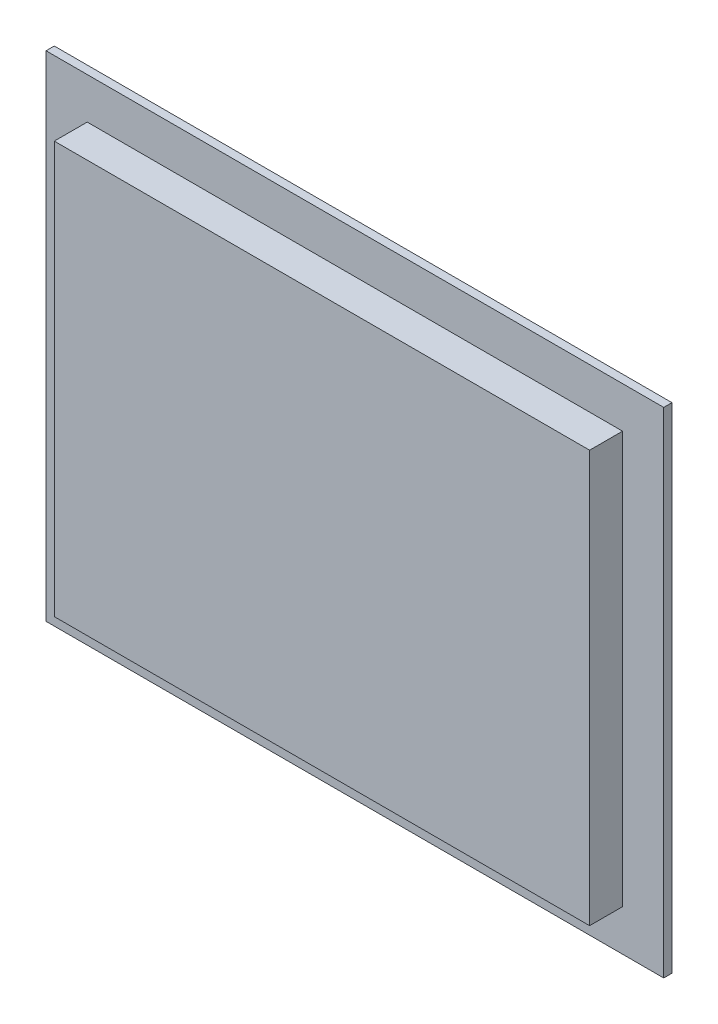
ISO-10303-21;
HEADER;
FILE_DESCRIPTION(('STEP AP214'),'2;1');
FILE_NAME('part.step','',(''),(''),'','','');
FILE_SCHEMA(('AUTOMOTIVE_DESIGN { 1 0 10303 214 1 1 1 1 }'));
ENDSEC;
DATA;
#1=APPLICATION_CONTEXT('core data for automotive mechanical design processes');
#2=APPLICATION_PROTOCOL_DEFINITION('international standard','automotive_design',2000,#1);
#3=PRODUCT_CONTEXT('',#1,'mechanical');
#4=PRODUCT('Part','Part','',(#3));
#5=PRODUCT_RELATED_PRODUCT_CATEGORY('part','',(#4));
#6=PRODUCT_DEFINITION_FORMATION('','',#4);
#7=PRODUCT_DEFINITION_CONTEXT('part definition',#1,'design');
#8=PRODUCT_DEFINITION('design','',#6,#7);
#9=PRODUCT_DEFINITION_SHAPE('','',#8);
#10=(LENGTH_UNIT() NAMED_UNIT(*) SI_UNIT(.MILLI.,.METRE.));
#11=(NAMED_UNIT(*) PLANE_ANGLE_UNIT() SI_UNIT($,.RADIAN.));
#12=(NAMED_UNIT(*) SI_UNIT($,.STERADIAN.) SOLID_ANGLE_UNIT());
#13=UNCERTAINTY_MEASURE_WITH_UNIT(LENGTH_MEASURE(1.E-05),#10,'distance_accuracy_value','');
#14=(GEOMETRIC_REPRESENTATION_CONTEXT(3) GLOBAL_UNCERTAINTY_ASSIGNED_CONTEXT((#13)) GLOBAL_UNIT_ASSIGNED_CONTEXT((#10,
#11,#12)) REPRESENTATION_CONTEXT('',''));
#15=CARTESIAN_POINT('',(0.,0.,0.));
#16=DIRECTION('',(0.,0.,1.));
#17=DIRECTION('',(1.,0.,0.));
#18=AXIS2_PLACEMENT_3D('',#15,#16,#17);
#19=CARTESIAN_POINT('',(0.,0.,4.));
#20=DIRECTION('',(0.,0.,-1.));
#21=DIRECTION('',(-1.,0.,0.));
#22=AXIS2_PLACEMENT_3D('',#19,#20,#21);
#23=PLANE('',#22);
#24=DIRECTION('',(0.,1.,0.));
#25=VECTOR('',#24,1.);
#26=CARTESIAN_POINT('',(150.,-120.,4.));
#27=LINE('',#26,#25);
#28=CARTESIAN_POINT('',(150.,-120.,4.));
#29=VERTEX_POINT('',#28);
#30=CARTESIAN_POINT('',(150.,120.,4.));
#31=VERTEX_POINT('',#30);
#32=EDGE_CURVE('E189',#29,#31,#27,.T.);
#33=ORIENTED_EDGE('',*,*,#32,.T.);
#34=DIRECTION('',(-1.,0.,0.));
#35=VECTOR('',#34,1.);
#36=CARTESIAN_POINT('',(-150.,120.,4.));
#37=LINE('',#36,#35);
#38=CARTESIAN_POINT('',(-150.,120.,4.));
#39=VERTEX_POINT('',#38);
#40=EDGE_CURVE('E193',#31,#39,#37,.T.);
#41=ORIENTED_EDGE('',*,*,#40,.T.);
#42=DIRECTION('',(0.,-1.,0.));
#43=VECTOR('',#42,1.);
#44=CARTESIAN_POINT('',(-150.,-120.,4.));
#45=LINE('',#44,#43);
#46=CARTESIAN_POINT('',(-150.,-120.,4.));
#47=VERTEX_POINT('',#46);
#48=EDGE_CURVE('E197',#39,#47,#45,.T.);
#49=ORIENTED_EDGE('',*,*,#48,.T.);
#50=DIRECTION('',(1.,0.,0.));
#51=VECTOR('',#50,1.);
#52=CARTESIAN_POINT('',(-150.,-120.,4.));
#53=LINE('',#52,#51);
#54=EDGE_CURVE('E200',#47,#29,#53,.T.);
#55=ORIENTED_EDGE('',*,*,#54,.T.);
#56=EDGE_LOOP('',(#33,#41,#49,#55));
#57=FACE_BOUND('',#56,.T.);
#58=DIRECTION('',(0.,-1.,0.));
#59=VECTOR('',#58,1.);
#60=CARTESIAN_POINT('',(-130.,-100.,4.));
#61=LINE('',#60,#59);
#62=CARTESIAN_POINT('',(-130.,100.,4.));
#63=VERTEX_POINT('',#62);
#64=CARTESIAN_POINT('',(-130.,-100.,4.));
#65=VERTEX_POINT('',#64);
#66=EDGE_CURVE('E166',#63,#65,#61,.T.);
#67=ORIENTED_EDGE('',*,*,#66,.F.);
#68=DIRECTION('',(-1.,0.,0.));
#69=VECTOR('',#68,1.);
#70=CARTESIAN_POINT('',(-130.,100.,4.));
#71=LINE('',#70,#69);
#72=CARTESIAN_POINT('',(130.,100.,4.));
#73=VERTEX_POINT('',#72);
#74=EDGE_CURVE('E63',#73,#63,#71,.T.);
#75=ORIENTED_EDGE('',*,*,#74,.F.);
#76=DIRECTION('',(0.,1.,0.));
#77=VECTOR('',#76,1.);
#78=CARTESIAN_POINT('',(130.,-100.,4.));
#79=LINE('',#78,#77);
#80=CARTESIAN_POINT('',(130.,-100.,4.));
#81=VERTEX_POINT('',#80);
#82=EDGE_CURVE('E183',#81,#73,#79,.T.);
#83=ORIENTED_EDGE('',*,*,#82,.F.);
#84=DIRECTION('',(1.,0.,0.));
#85=VECTOR('',#84,1.);
#86=CARTESIAN_POINT('',(-130.,-100.,4.));
#87=LINE('',#86,#85);
#88=EDGE_CURVE('E179',#65,#81,#87,.T.);
#89=ORIENTED_EDGE('',*,*,#88,.F.);
#90=EDGE_LOOP('',(#67,#75,#83,#89));
#91=FACE_BOUND('',#90,.T.);
#92=ADVANCED_FACE('F39',(#57,#91),#23,.F.);
#93=CARTESIAN_POINT('',(0.,0.,0.));
#94=DIRECTION('',(0.,0.,-1.));
#95=DIRECTION('',(-1.,0.,0.));
#96=AXIS2_PLACEMENT_3D('',#93,#94,#95);
#97=PLANE('',#96);
#98=DIRECTION('',(0.,1.,0.));
#99=VECTOR('',#98,1.);
#100=CARTESIAN_POINT('',(150.,-120.,0.));
#101=LINE('',#100,#99);
#102=CARTESIAN_POINT('',(150.,-120.,0.));
#103=VERTEX_POINT('',#102);
#104=CARTESIAN_POINT('',(150.,120.,0.));
#105=VERTEX_POINT('',#104);
#106=EDGE_CURVE('E188',#103,#105,#101,.T.);
#107=ORIENTED_EDGE('',*,*,#106,.F.);
#108=DIRECTION('',(1.,0.,0.));
#109=VECTOR('',#108,1.);
#110=CARTESIAN_POINT('',(-150.,-120.,0.));
#111=LINE('',#110,#109);
#112=CARTESIAN_POINT('',(-150.,-120.,0.));
#113=VERTEX_POINT('',#112);
#114=EDGE_CURVE('E194',#113,#103,#111,.T.);
#115=ORIENTED_EDGE('',*,*,#114,.F.);
#116=DIRECTION('',(0.,-1.,0.));
#117=VECTOR('',#116,1.);
#118=CARTESIAN_POINT('',(-150.,-120.,0.));
#119=LINE('',#118,#117);
#120=CARTESIAN_POINT('',(-150.,120.,0.));
#121=VERTEX_POINT('',#120);
#122=EDGE_CURVE('E210',#121,#113,#119,.T.);
#123=ORIENTED_EDGE('',*,*,#122,.F.);
#124=DIRECTION('',(-1.,0.,0.));
#125=VECTOR('',#124,1.);
#126=CARTESIAN_POINT('',(-150.,120.,0.));
#127=LINE('',#126,#125);
#128=EDGE_CURVE('E207',#105,#121,#127,.T.);
#129=ORIENTED_EDGE('',*,*,#128,.F.);
#130=EDGE_LOOP('',(#107,#115,#123,#129));
#131=FACE_BOUND('',#130,.T.);
#132=DIRECTION('',(0.,1.,0.));
#133=VECTOR('',#132,1.);
#134=CARTESIAN_POINT('',(126.1,-97.,0.));
#135=LINE('',#134,#133);
#136=CARTESIAN_POINT('',(126.1,-97.,0.));
#137=VERTEX_POINT('',#136);
#138=CARTESIAN_POINT('',(126.1,97.,0.));
#139=VERTEX_POINT('',#138);
#140=EDGE_CURVE('E296',#137,#139,#135,.T.);
#141=ORIENTED_EDGE('',*,*,#140,.T.);
#142=DIRECTION('',(-1.,0.,0.));
#143=VECTOR('',#142,1.);
#144=CARTESIAN_POINT('',(-126.1,97.,0.));
#145=LINE('',#144,#143);
#146=CARTESIAN_POINT('',(-126.1,97.,0.));
#147=VERTEX_POINT('',#146);
#148=EDGE_CURVE('E148',#139,#147,#145,.T.);
#149=ORIENTED_EDGE('',*,*,#148,.T.);
#150=DIRECTION('',(0.,-1.,0.));
#151=VECTOR('',#150,1.);
#152=CARTESIAN_POINT('',(-126.1,-97.,0.));
#153=LINE('',#152,#151);
#154=CARTESIAN_POINT('',(-126.1,-97.,0.));
#155=VERTEX_POINT('',#154);
#156=EDGE_CURVE('E159',#147,#155,#153,.T.);
#157=ORIENTED_EDGE('',*,*,#156,.T.);
#158=DIRECTION('',(1.,0.,0.));
#159=VECTOR('',#158,1.);
#160=CARTESIAN_POINT('',(-126.1,-97.,0.));
#161=LINE('',#160,#159);
#162=EDGE_CURVE('E152',#155,#137,#161,.T.);
#163=ORIENTED_EDGE('',*,*,#162,.T.);
#164=EDGE_LOOP('',(#141,#149,#157,#163));
#165=FACE_BOUND('',#164,.T.);
#166=ADVANCED_FACE('F233',(#131,#165),#97,.T.);
#167=CARTESIAN_POINT('',(150.,-120.,4.));
#168=DIRECTION('',(-1.,0.,0.));
#169=DIRECTION('',(0.,0.,1.));
#170=AXIS2_PLACEMENT_3D('',#167,#168,#169);
#171=PLANE('',#170);
#172=ORIENTED_EDGE('',*,*,#106,.T.);
#173=DIRECTION('',(0.,0.,-1.));
#174=VECTOR('',#173,1.);
#175=CARTESIAN_POINT('',(150.,120.,4.));
#176=LINE('',#175,#174);
#177=EDGE_CURVE('E11',#31,#105,#176,.T.);
#178=ORIENTED_EDGE('',*,*,#177,.F.);
#179=ORIENTED_EDGE('',*,*,#32,.F.);
#180=DIRECTION('',(0.,0.,-1.));
#181=VECTOR('',#180,1.);
#182=CARTESIAN_POINT('',(150.,-120.,4.));
#183=LINE('',#182,#181);
#184=EDGE_CURVE('E203',#29,#103,#183,.T.);
#185=ORIENTED_EDGE('',*,*,#184,.T.);
#186=EDGE_LOOP('',(#172,#178,#179,#185));
#187=FACE_BOUND('',#186,.T.);
#188=ADVANCED_FACE('F41',(#187),#171,.F.);
#189=CARTESIAN_POINT('',(-150.,120.,4.));
#190=DIRECTION('',(0.,-1.,0.));
#191=DIRECTION('',(0.,0.,-1.));
#192=AXIS2_PLACEMENT_3D('',#189,#190,#191);
#193=PLANE('',#192);
#194=ORIENTED_EDGE('',*,*,#128,.T.);
#195=DIRECTION('',(0.,0.,-1.));
#196=VECTOR('',#195,1.);
#197=CARTESIAN_POINT('',(-150.,120.,4.));
#198=LINE('',#197,#196);
#199=EDGE_CURVE('E48',#39,#121,#198,.T.);
#200=ORIENTED_EDGE('',*,*,#199,.F.);
#201=ORIENTED_EDGE('',*,*,#40,.F.);
#202=ORIENTED_EDGE('',*,*,#177,.T.);
#203=EDGE_LOOP('',(#194,#200,#201,#202));
#204=FACE_BOUND('',#203,.T.);
#205=ADVANCED_FACE('F243',(#204),#193,.F.);
#206=CARTESIAN_POINT('',(-150.,-120.,4.));
#207=DIRECTION('',(1.,0.,0.));
#208=DIRECTION('',(0.,0.,-1.));
#209=AXIS2_PLACEMENT_3D('',#206,#207,#208);
#210=PLANE('',#209);
#211=ORIENTED_EDGE('',*,*,#122,.T.);
#212=DIRECTION('',(0.,0.,-1.));
#213=VECTOR('',#212,1.);
#214=CARTESIAN_POINT('',(-150.,-120.,4.));
#215=LINE('',#214,#213);
#216=EDGE_CURVE('E218',#47,#113,#215,.T.);
#217=ORIENTED_EDGE('',*,*,#216,.F.);
#218=ORIENTED_EDGE('',*,*,#48,.F.);
#219=ORIENTED_EDGE('',*,*,#199,.T.);
#220=EDGE_LOOP('',(#211,#217,#218,#219));
#221=FACE_BOUND('',#220,.T.);
#222=ADVANCED_FACE('F227',(#221),#210,.F.);
#223=CARTESIAN_POINT('',(-150.,-120.,4.));
#224=DIRECTION('',(0.,1.,0.));
#225=DIRECTION('',(0.,0.,1.));
#226=AXIS2_PLACEMENT_3D('',#223,#224,#225);
#227=PLANE('',#226);
#228=ORIENTED_EDGE('',*,*,#114,.T.);
#229=ORIENTED_EDGE('',*,*,#184,.F.);
#230=ORIENTED_EDGE('',*,*,#54,.F.);
#231=ORIENTED_EDGE('',*,*,#216,.T.);
#232=EDGE_LOOP('',(#228,#229,#230,#231));
#233=FACE_BOUND('',#232,.T.);
#234=ADVANCED_FACE('F237',(#233),#227,.F.);
#235=CARTESIAN_POINT('',(-130.,-100.,0.));
#236=DIRECTION('',(0.,-1.,0.));
#237=DIRECTION('',(0.,0.,-1.));
#238=AXIS2_PLACEMENT_3D('',#235,#236,#237);
#239=PLANE('',#238);
#240=ORIENTED_EDGE('',*,*,#88,.T.);
#241=DIRECTION('',(0.,0.,1.));
#242=VECTOR('',#241,1.);
#243=CARTESIAN_POINT('',(130.,-100.,0.));
#244=LINE('',#243,#242);
#245=CARTESIAN_POINT('',(130.,-100.,20.));
#246=VERTEX_POINT('',#245);
#247=EDGE_CURVE('E163',#81,#246,#244,.T.);
#248=ORIENTED_EDGE('',*,*,#247,.T.);
#249=DIRECTION('',(1.,0.,0.));
#250=VECTOR('',#249,1.);
#251=CARTESIAN_POINT('',(-130.,-100.,20.));
#252=LINE('',#251,#250);
#253=CARTESIAN_POINT('',(-130.,-100.,20.));
#254=VERTEX_POINT('',#253);
#255=EDGE_CURVE('E291',#254,#246,#252,.T.);
#256=ORIENTED_EDGE('',*,*,#255,.F.);
#257=DIRECTION('',(0.,0.,1.));
#258=VECTOR('',#257,1.);
#259=CARTESIAN_POINT('',(-130.,-100.,0.));
#260=LINE('',#259,#258);
#261=EDGE_CURVE('E167',#65,#254,#260,.T.);
#262=ORIENTED_EDGE('',*,*,#261,.F.);
#263=EDGE_LOOP('',(#240,#248,#256,#262));
#264=FACE_BOUND('',#263,.T.);
#265=ADVANCED_FACE('F261',(#264),#239,.T.);
#266=CARTESIAN_POINT('',(-130.,100.,0.));
#267=DIRECTION('',(0.,1.,0.));
#268=DIRECTION('',(0.,0.,1.));
#269=AXIS2_PLACEMENT_3D('',#266,#267,#268);
#270=PLANE('',#269);
#271=ORIENTED_EDGE('',*,*,#74,.T.);
#272=DIRECTION('',(0.,0.,1.));
#273=VECTOR('',#272,1.);
#274=CARTESIAN_POINT('',(-130.,100.,0.));
#275=LINE('',#274,#273);
#276=CARTESIAN_POINT('',(-130.,100.,20.));
#277=VERTEX_POINT('',#276);
#278=EDGE_CURVE('E170',#63,#277,#275,.T.);
#279=ORIENTED_EDGE('',*,*,#278,.T.);
#280=DIRECTION('',(-1.,0.,0.));
#281=VECTOR('',#280,1.);
#282=CARTESIAN_POINT('',(-130.,100.,20.));
#283=LINE('',#282,#281);
#284=CARTESIAN_POINT('',(130.,100.,20.));
#285=VERTEX_POINT('',#284);
#286=EDGE_CURVE('E302',#285,#277,#283,.T.);
#287=ORIENTED_EDGE('',*,*,#286,.F.);
#288=DIRECTION('',(0.,0.,1.));
#289=VECTOR('',#288,1.);
#290=CARTESIAN_POINT('',(130.,100.,0.));
#291=LINE('',#290,#289);
#292=EDGE_CURVE('E173',#73,#285,#291,.T.);
#293=ORIENTED_EDGE('',*,*,#292,.F.);
#294=EDGE_LOOP('',(#271,#279,#287,#293));
#295=FACE_BOUND('',#294,.T.);
#296=ADVANCED_FACE('F265',(#295),#270,.T.);
#297=CARTESIAN_POINT('',(130.,-100.,0.));
#298=DIRECTION('',(1.,0.,0.));
#299=DIRECTION('',(0.,0.,-1.));
#300=AXIS2_PLACEMENT_3D('',#297,#298,#299);
#301=PLANE('',#300);
#302=ORIENTED_EDGE('',*,*,#82,.T.);
#303=ORIENTED_EDGE('',*,*,#292,.T.);
#304=DIRECTION('',(0.,1.,0.));
#305=VECTOR('',#304,1.);
#306=CARTESIAN_POINT('',(130.,-100.,20.));
#307=LINE('',#306,#305);
#308=EDGE_CURVE('E322',#246,#285,#307,.T.);
#309=ORIENTED_EDGE('',*,*,#308,.F.);
#310=ORIENTED_EDGE('',*,*,#247,.F.);
#311=EDGE_LOOP('',(#302,#303,#309,#310));
#312=FACE_BOUND('',#311,.T.);
#313=ADVANCED_FACE('F257',(#312),#301,.T.);
#314=CARTESIAN_POINT('',(-130.,-100.,0.));
#315=DIRECTION('',(-1.,0.,0.));
#316=DIRECTION('',(0.,0.,1.));
#317=AXIS2_PLACEMENT_3D('',#314,#315,#316);
#318=PLANE('',#317);
#319=ORIENTED_EDGE('',*,*,#66,.T.);
#320=ORIENTED_EDGE('',*,*,#261,.T.);
#321=DIRECTION('',(0.,-1.,0.));
#322=VECTOR('',#321,1.);
#323=CARTESIAN_POINT('',(-130.,-100.,20.));
#324=LINE('',#323,#322);
#325=EDGE_CURVE('E297',#277,#254,#324,.T.);
#326=ORIENTED_EDGE('',*,*,#325,.F.);
#327=ORIENTED_EDGE('',*,*,#278,.F.);
#328=EDGE_LOOP('',(#319,#320,#326,#327));
#329=FACE_BOUND('',#328,.T.);
#330=ADVANCED_FACE('F275',(#329),#318,.T.);
#331=CARTESIAN_POINT('',(126.1,-97.,0.));
#332=DIRECTION('',(1.,0.,0.));
#333=DIRECTION('',(0.,0.,-1.));
#334=AXIS2_PLACEMENT_3D('',#331,#332,#333);
#335=PLANE('',#334);
#336=DIRECTION('',(0.,0.,1.));
#337=VECTOR('',#336,1.);
#338=CARTESIAN_POINT('',(126.1,-97.,0.));
#339=LINE('',#338,#337);
#340=CARTESIAN_POINT('',(126.1,-97.,16.));
#341=VERTEX_POINT('',#340);
#342=EDGE_CURVE('E143',#137,#341,#339,.T.);
#343=ORIENTED_EDGE('',*,*,#342,.T.);
#344=DIRECTION('',(0.,1.,0.));
#345=VECTOR('',#344,1.);
#346=CARTESIAN_POINT('',(126.1,-97.,16.));
#347=LINE('',#346,#345);
#348=CARTESIAN_POINT('',(126.1,97.,16.));
#349=VERTEX_POINT('',#348);
#350=EDGE_CURVE('E129',#341,#349,#347,.T.);
#351=ORIENTED_EDGE('',*,*,#350,.T.);
#352=DIRECTION('',(0.,0.,1.));
#353=VECTOR('',#352,1.);
#354=CARTESIAN_POINT('',(126.1,97.,0.));
#355=LINE('',#354,#353);
#356=EDGE_CURVE('E141',#139,#349,#355,.T.);
#357=ORIENTED_EDGE('',*,*,#356,.F.);
#358=ORIENTED_EDGE('',*,*,#140,.F.);
#359=EDGE_LOOP('',(#343,#351,#357,#358));
#360=FACE_BOUND('',#359,.T.);
#361=ADVANCED_FACE('F139',(#360),#335,.F.);
#362=CARTESIAN_POINT('',(-126.1,-97.,0.));
#363=DIRECTION('',(0.,-1.,0.));
#364=DIRECTION('',(0.,0.,-1.));
#365=AXIS2_PLACEMENT_3D('',#362,#363,#364);
#366=PLANE('',#365);
#367=DIRECTION('',(0.,0.,1.));
#368=VECTOR('',#367,1.);
#369=CARTESIAN_POINT('',(-126.1,-97.,0.));
#370=LINE('',#369,#368);
#371=CARTESIAN_POINT('',(-126.1,-97.,16.));
#372=VERTEX_POINT('',#371);
#373=EDGE_CURVE('E156',#155,#372,#370,.T.);
#374=ORIENTED_EDGE('',*,*,#373,.T.);
#375=DIRECTION('',(1.,0.,0.));
#376=VECTOR('',#375,1.);
#377=CARTESIAN_POINT('',(-126.1,-97.,16.));
#378=LINE('',#377,#376);
#379=EDGE_CURVE('E316',#372,#341,#378,.T.);
#380=ORIENTED_EDGE('',*,*,#379,.T.);
#381=ORIENTED_EDGE('',*,*,#342,.F.);
#382=ORIENTED_EDGE('',*,*,#162,.F.);
#383=EDGE_LOOP('',(#374,#380,#381,#382));
#384=FACE_BOUND('',#383,.T.);
#385=ADVANCED_FACE('F282',(#384),#366,.F.);
#386=CARTESIAN_POINT('',(-126.1,-97.,0.));
#387=DIRECTION('',(-1.,0.,0.));
#388=DIRECTION('',(0.,0.,1.));
#389=AXIS2_PLACEMENT_3D('',#386,#387,#388);
#390=PLANE('',#389);
#391=DIRECTION('',(0.,0.,1.));
#392=VECTOR('',#391,1.);
#393=CARTESIAN_POINT('',(-126.1,97.,0.));
#394=LINE('',#393,#392);
#395=CARTESIAN_POINT('',(-126.1,97.,16.));
#396=VERTEX_POINT('',#395);
#397=EDGE_CURVE('E151',#147,#396,#394,.T.);
#398=ORIENTED_EDGE('',*,*,#397,.T.);
#399=DIRECTION('',(0.,-1.,0.));
#400=VECTOR('',#399,1.);
#401=CARTESIAN_POINT('',(-126.1,-97.,16.));
#402=LINE('',#401,#400);
#403=EDGE_CURVE('E55',#396,#372,#402,.T.);
#404=ORIENTED_EDGE('',*,*,#403,.T.);
#405=ORIENTED_EDGE('',*,*,#373,.F.);
#406=ORIENTED_EDGE('',*,*,#156,.F.);
#407=EDGE_LOOP('',(#398,#404,#405,#406));
#408=FACE_BOUND('',#407,.T.);
#409=ADVANCED_FACE('F318',(#408),#390,.F.);
#410=CARTESIAN_POINT('',(-126.1,97.,0.));
#411=DIRECTION('',(0.,1.,0.));
#412=DIRECTION('',(0.,0.,1.));
#413=AXIS2_PLACEMENT_3D('',#410,#411,#412);
#414=PLANE('',#413);
#415=ORIENTED_EDGE('',*,*,#356,.T.);
#416=DIRECTION('',(-1.,0.,0.));
#417=VECTOR('',#416,1.);
#418=CARTESIAN_POINT('',(-126.1,97.,16.));
#419=LINE('',#418,#417);
#420=EDGE_CURVE('E126',#349,#396,#419,.T.);
#421=ORIENTED_EDGE('',*,*,#420,.T.);
#422=ORIENTED_EDGE('',*,*,#397,.F.);
#423=ORIENTED_EDGE('',*,*,#148,.F.);
#424=EDGE_LOOP('',(#415,#421,#422,#423));
#425=FACE_BOUND('',#424,.T.);
#426=ADVANCED_FACE('F146',(#425),#414,.F.);
#427=CARTESIAN_POINT('',(0.,0.,20.));
#428=DIRECTION('',(0.,0.,-1.));
#429=DIRECTION('',(-1.,0.,0.));
#430=AXIS2_PLACEMENT_3D('',#427,#428,#429);
#431=PLANE('',#430);
#432=ORIENTED_EDGE('',*,*,#308,.T.);
#433=ORIENTED_EDGE('',*,*,#286,.T.);
#434=ORIENTED_EDGE('',*,*,#325,.T.);
#435=ORIENTED_EDGE('',*,*,#255,.T.);
#436=EDGE_LOOP('',(#432,#433,#434,#435));
#437=FACE_BOUND('',#436,.T.);
#438=ADVANCED_FACE('F329',(#437),#431,.F.);
#439=CARTESIAN_POINT('',(0.,0.,16.));
#440=DIRECTION('',(0.,0.,-1.));
#441=DIRECTION('',(-1.,0.,0.));
#442=AXIS2_PLACEMENT_3D('',#439,#440,#441);
#443=PLANE('',#442);
#444=ORIENTED_EDGE('',*,*,#350,.F.);
#445=ORIENTED_EDGE('',*,*,#379,.F.);
#446=ORIENTED_EDGE('',*,*,#403,.F.);
#447=ORIENTED_EDGE('',*,*,#420,.F.);
#448=EDGE_LOOP('',(#444,#445,#446,#447));
#449=FACE_BOUND('',#448,.T.);
#450=ADVANCED_FACE('F128',(#449),#443,.T.);
#451=CLOSED_SHELL('',(#92,#166,#188,#205,#222,#234,#265,#296,#313,#330,#361,#385,#409,#426,#438,#450));
#452=MANIFOLD_SOLID_BREP('B2',#451);
#453=ADVANCED_BREP_SHAPE_REPRESENTATION('',(#18,#452),#14);
#454=SHAPE_DEFINITION_REPRESENTATION(#9,#453);
ENDSEC;
END-ISO-10303-21;
